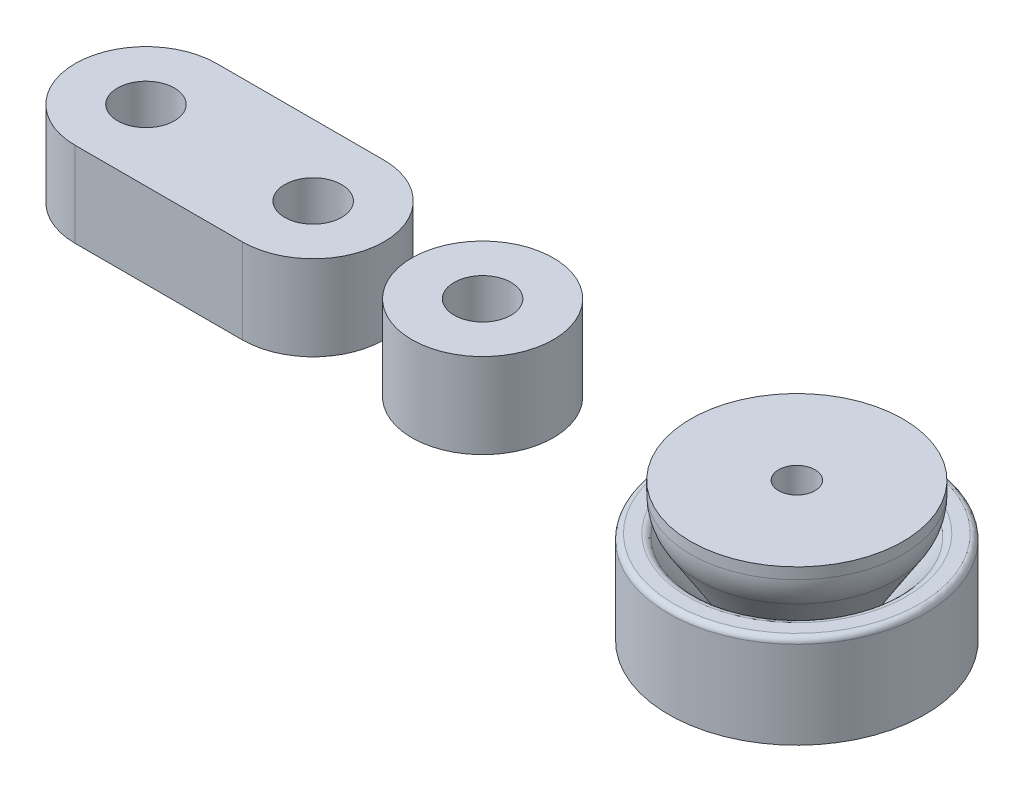
ISO-10303-21;
HEADER;
FILE_DESCRIPTION(('STEP AP214'),'2;1');
FILE_NAME('part.step','',(''),(''),'','','');
FILE_SCHEMA(('AUTOMOTIVE_DESIGN { 1 0 10303 214 1 1 1 1 }'));
ENDSEC;
DATA;
#1=APPLICATION_CONTEXT('core data for automotive mechanical design processes');
#2=APPLICATION_PROTOCOL_DEFINITION('international standard','automotive_design',2000,#1);
#3=PRODUCT_CONTEXT('',#1,'mechanical');
#4=PRODUCT('Part','Part','',(#3));
#5=PRODUCT_RELATED_PRODUCT_CATEGORY('part','',(#4));
#6=PRODUCT_DEFINITION_FORMATION('','',#4);
#7=PRODUCT_DEFINITION_CONTEXT('part definition',#1,'design');
#8=PRODUCT_DEFINITION('design','',#6,#7);
#9=PRODUCT_DEFINITION_SHAPE('','',#8);
#10=(LENGTH_UNIT() NAMED_UNIT(*) SI_UNIT(.MILLI.,.METRE.));
#11=(NAMED_UNIT(*) PLANE_ANGLE_UNIT() SI_UNIT($,.RADIAN.));
#12=(NAMED_UNIT(*) SI_UNIT($,.STERADIAN.) SOLID_ANGLE_UNIT());
#13=UNCERTAINTY_MEASURE_WITH_UNIT(LENGTH_MEASURE(1.E-05),#10,'distance_accuracy_value','');
#14=(GEOMETRIC_REPRESENTATION_CONTEXT(3) GLOBAL_UNCERTAINTY_ASSIGNED_CONTEXT((#13)) GLOBAL_UNIT_ASSIGNED_CONTEXT((#10,
#11,#12)) REPRESENTATION_CONTEXT('',''));
#15=CARTESIAN_POINT('',(0.,0.,0.));
#16=DIRECTION('',(0.,0.,1.));
#17=DIRECTION('',(1.,0.,0.));
#18=AXIS2_PLACEMENT_3D('',#15,#16,#17);
#19=CARTESIAN_POINT('',(-58.3806821295014,12.4587,0.));
#20=DIRECTION('',(0.,-1.,0.));
#21=DIRECTION('',(0.,0.,-1.));
#22=AXIS2_PLACEMENT_3D('',#19,#20,#21);
#23=CYLINDRICAL_SURFACE('',#22,6.35);
#24=CARTESIAN_POINT('',(-58.3806821295014,4.8387,0.));
#25=DIRECTION('',(0.,1.,0.));
#26=DIRECTION('',(0.,0.,1.));
#27=AXIS2_PLACEMENT_3D('',#24,#25,#26);
#28=CIRCLE('',#27,6.35);
#29=CARTESIAN_POINT('',(-58.3806821295014,4.8387,-6.35));
#30=VERTEX_POINT('',#29);
#31=CARTESIAN_POINT('',(-58.3806821295014,4.8387,6.35));
#32=VERTEX_POINT('',#31);
#33=EDGE_CURVE('E108',#30,#32,#28,.T.);
#34=ORIENTED_EDGE('',*,*,#33,.T.);
#35=DIRECTION('',(0.,-1.,0.));
#36=VECTOR('',#35,1.);
#37=CARTESIAN_POINT('',(-58.3806821295014,12.4587,6.35));
#38=LINE('',#37,#36);
#39=CARTESIAN_POINT('',(-58.3806821295014,12.4587,6.35));
#40=VERTEX_POINT('',#39);
#41=EDGE_CURVE('E12',#40,#32,#38,.T.);
#42=ORIENTED_EDGE('',*,*,#41,.F.);
#43=CARTESIAN_POINT('',(-58.3806821295014,12.4587,0.));
#44=DIRECTION('',(0.,1.,0.));
#45=DIRECTION('',(0.,0.,1.));
#46=AXIS2_PLACEMENT_3D('',#43,#44,#45);
#47=CIRCLE('',#46,6.35);
#48=CARTESIAN_POINT('',(-58.3806821295014,12.4587,-6.35));
#49=VERTEX_POINT('',#48);
#50=EDGE_CURVE('E96',#49,#40,#47,.T.);
#51=ORIENTED_EDGE('',*,*,#50,.F.);
#52=DIRECTION('',(0.,-1.,0.));
#53=VECTOR('',#52,1.);
#54=CARTESIAN_POINT('',(-58.3806821295014,12.4587,-6.35));
#55=LINE('',#54,#53);
#56=EDGE_CURVE('E104',#49,#30,#55,.T.);
#57=ORIENTED_EDGE('',*,*,#56,.T.);
#58=EDGE_LOOP('',(#34,#42,#51,#57));
#59=FACE_BOUND('',#58,.T.);
#60=ADVANCED_FACE('F45',(#59),#23,.T.);
#61=CARTESIAN_POINT('',(-58.3806821295014,12.4587,6.35));
#62=DIRECTION('',(0.,0.,-1.));
#63=DIRECTION('',(-1.,0.,0.));
#64=AXIS2_PLACEMENT_3D('',#61,#62,#63);
#65=PLANE('',#64);
#66=DIRECTION('',(1.,0.,0.));
#67=VECTOR('',#66,1.);
#68=CARTESIAN_POINT('',(-58.3806821295014,4.8387,6.35));
#69=LINE('',#68,#67);
#70=CARTESIAN_POINT('',(-43.3806821295014,4.8387,6.35));
#71=VERTEX_POINT('',#70);
#72=EDGE_CURVE('E100',#32,#71,#69,.T.);
#73=ORIENTED_EDGE('',*,*,#72,.T.);
#74=DIRECTION('',(0.,-1.,0.));
#75=VECTOR('',#74,1.);
#76=CARTESIAN_POINT('',(-43.3806821295014,12.4587,6.35));
#77=LINE('',#76,#75);
#78=CARTESIAN_POINT('',(-43.3806821295014,12.4587,6.35));
#79=VERTEX_POINT('',#78);
#80=EDGE_CURVE('E53',#79,#71,#77,.T.);
#81=ORIENTED_EDGE('',*,*,#80,.F.);
#82=DIRECTION('',(1.,0.,0.));
#83=VECTOR('',#82,1.);
#84=CARTESIAN_POINT('',(-58.3806821295014,12.4587,6.35));
#85=LINE('',#84,#83);
#86=EDGE_CURVE('E91',#40,#79,#85,.T.);
#87=ORIENTED_EDGE('',*,*,#86,.F.);
#88=ORIENTED_EDGE('',*,*,#41,.T.);
#89=EDGE_LOOP('',(#73,#81,#87,#88));
#90=FACE_BOUND('',#89,.T.);
#91=ADVANCED_FACE('F99',(#90),#65,.F.);
#92=CARTESIAN_POINT('',(-43.3806821295014,12.4587,0.));
#93=DIRECTION('',(0.,-1.,0.));
#94=DIRECTION('',(0.,0.,-1.));
#95=AXIS2_PLACEMENT_3D('',#92,#93,#94);
#96=CYLINDRICAL_SURFACE('',#95,6.35);
#97=CARTESIAN_POINT('',(-43.3806821295014,4.8387,0.));
#98=DIRECTION('',(0.,1.,0.));
#99=DIRECTION('',(0.,0.,1.));
#100=AXIS2_PLACEMENT_3D('',#97,#98,#99);
#101=CIRCLE('',#100,6.35);
#102=CARTESIAN_POINT('',(-43.3806821295014,4.8387,-6.35));
#103=VERTEX_POINT('',#102);
#104=EDGE_CURVE('E78',#71,#103,#101,.T.);
#105=ORIENTED_EDGE('',*,*,#104,.T.);
#106=DIRECTION('',(0.,-1.,0.));
#107=VECTOR('',#106,1.);
#108=CARTESIAN_POINT('',(-43.3806821295014,12.4587,-6.35));
#109=LINE('',#108,#107);
#110=CARTESIAN_POINT('',(-43.3806821295014,12.4587,-6.35));
#111=VERTEX_POINT('',#110);
#112=EDGE_CURVE('E101',#111,#103,#109,.T.);
#113=ORIENTED_EDGE('',*,*,#112,.F.);
#114=CARTESIAN_POINT('',(-43.3806821295014,12.4587,0.));
#115=DIRECTION('',(0.,1.,0.));
#116=DIRECTION('',(0.,0.,1.));
#117=AXIS2_PLACEMENT_3D('',#114,#115,#116);
#118=CIRCLE('',#117,6.35);
#119=EDGE_CURVE('E94',#79,#111,#118,.T.);
#120=ORIENTED_EDGE('',*,*,#119,.F.);
#121=ORIENTED_EDGE('',*,*,#80,.T.);
#122=EDGE_LOOP('',(#105,#113,#120,#121));
#123=FACE_BOUND('',#122,.T.);
#124=ADVANCED_FACE('F102',(#123),#96,.T.);
#125=CARTESIAN_POINT('',(-58.3806821295014,12.4587,-6.35));
#126=DIRECTION('',(0.,0.,1.));
#127=DIRECTION('',(1.,0.,0.));
#128=AXIS2_PLACEMENT_3D('',#125,#126,#127);
#129=PLANE('',#128);
#130=DIRECTION('',(-1.,0.,0.));
#131=VECTOR('',#130,1.);
#132=CARTESIAN_POINT('',(-58.3806821295014,4.8387,-6.35));
#133=LINE('',#132,#131);
#134=EDGE_CURVE('E84',#103,#30,#133,.T.);
#135=ORIENTED_EDGE('',*,*,#134,.T.);
#136=ORIENTED_EDGE('',*,*,#56,.F.);
#137=DIRECTION('',(-1.,0.,0.));
#138=VECTOR('',#137,1.);
#139=CARTESIAN_POINT('',(-58.3806821295014,12.4587,-6.35));
#140=LINE('',#139,#138);
#141=EDGE_CURVE('E61',#111,#49,#140,.T.);
#142=ORIENTED_EDGE('',*,*,#141,.F.);
#143=ORIENTED_EDGE('',*,*,#112,.T.);
#144=EDGE_LOOP('',(#135,#136,#142,#143));
#145=FACE_BOUND('',#144,.T.);
#146=ADVANCED_FACE('F116',(#145),#129,.F.);
#147=CARTESIAN_POINT('',(-58.3806821295014,12.4587,0.));
#148=DIRECTION('',(0.,1.,0.));
#149=DIRECTION('',(0.,0.,1.));
#150=AXIS2_PLACEMENT_3D('',#147,#148,#149);
#151=PLANE('',#150);
#152=CARTESIAN_POINT('',(-43.3806821295014,12.4587,0.));
#153=DIRECTION('',(0.,-1.,0.));
#154=DIRECTION('',(0.,0.,-1.));
#155=AXIS2_PLACEMENT_3D('',#152,#153,#154);
#156=CIRCLE('',#155,2.5527);
#157=CARTESIAN_POINT('',(-43.3806821295014,12.4587,-2.5527));
#158=VERTEX_POINT('',#157);
#159=EDGE_CURVE('E130',#158,#158,#156,.T.);
#160=ORIENTED_EDGE('',*,*,#159,.T.);
#161=EDGE_LOOP('',(#160));
#162=FACE_BOUND('',#161,.T.);
#163=CARTESIAN_POINT('',(-58.3806821295014,12.4587,0.));
#164=DIRECTION('',(0.,-1.,0.));
#165=DIRECTION('',(0.,0.,-1.));
#166=AXIS2_PLACEMENT_3D('',#163,#164,#165);
#167=CIRCLE('',#166,2.5527);
#168=CARTESIAN_POINT('',(-58.3806821295014,12.4587,-2.5527));
#169=VERTEX_POINT('',#168);
#170=EDGE_CURVE('E111',#169,#169,#167,.T.);
#171=ORIENTED_EDGE('',*,*,#170,.T.);
#172=EDGE_LOOP('',(#171));
#173=FACE_BOUND('',#172,.T.);
#174=ORIENTED_EDGE('',*,*,#50,.T.);
#175=ORIENTED_EDGE('',*,*,#86,.T.);
#176=ORIENTED_EDGE('',*,*,#119,.T.);
#177=ORIENTED_EDGE('',*,*,#141,.T.);
#178=EDGE_LOOP('',(#174,#175,#176,#177));
#179=FACE_BOUND('',#178,.T.);
#180=ADVANCED_FACE('F92',(#162,#173,#179),#151,.T.);
#181=CARTESIAN_POINT('',(-58.3806821295014,4.8387,0.));
#182=DIRECTION('',(0.,1.,0.));
#183=DIRECTION('',(0.,0.,1.));
#184=AXIS2_PLACEMENT_3D('',#181,#182,#183);
#185=PLANE('',#184);
#186=CARTESIAN_POINT('',(-43.3806821295014,4.8387,0.));
#187=DIRECTION('',(0.,-1.,0.));
#188=DIRECTION('',(0.,0.,-1.));
#189=AXIS2_PLACEMENT_3D('',#186,#187,#188);
#190=CIRCLE('',#189,4.953);
#191=CARTESIAN_POINT('',(-43.3806821295014,4.8387,-4.953));
#192=VERTEX_POINT('',#191);
#193=EDGE_CURVE('E136',#192,#192,#190,.T.);
#194=ORIENTED_EDGE('',*,*,#193,.F.);
#195=EDGE_LOOP('',(#194));
#196=FACE_BOUND('',#195,.T.);
#197=CARTESIAN_POINT('',(-58.3806821295014,4.8387,0.));
#198=DIRECTION('',(0.,-1.,0.));
#199=DIRECTION('',(0.,0.,-1.));
#200=AXIS2_PLACEMENT_3D('',#197,#198,#199);
#201=CIRCLE('',#200,4.953);
#202=CARTESIAN_POINT('',(-58.3806821295014,4.8387,-4.953));
#203=VERTEX_POINT('',#202);
#204=EDGE_CURVE('E127',#203,#203,#201,.T.);
#205=ORIENTED_EDGE('',*,*,#204,.F.);
#206=EDGE_LOOP('',(#205));
#207=FACE_BOUND('',#206,.T.);
#208=ORIENTED_EDGE('',*,*,#33,.F.);
#209=ORIENTED_EDGE('',*,*,#134,.F.);
#210=ORIENTED_EDGE('',*,*,#104,.F.);
#211=ORIENTED_EDGE('',*,*,#72,.F.);
#212=EDGE_LOOP('',(#208,#209,#210,#211));
#213=FACE_BOUND('',#212,.T.);
#214=ADVANCED_FACE('F119',(#196,#207,#213),#185,.F.);
#215=CARTESIAN_POINT('',(-58.3806821295014,4.8387,0.));
#216=DIRECTION('',(0.,-1.,0.));
#217=DIRECTION('',(0.,0.,-1.));
#218=AXIS2_PLACEMENT_3D('',#215,#216,#217);
#219=CYLINDRICAL_SURFACE('',#218,2.5527);
#220=ORIENTED_EDGE('',*,*,#170,.F.);
#221=EDGE_LOOP('',(#220));
#222=FACE_BOUND('',#221,.T.);
#223=CARTESIAN_POINT('',(-58.3806821295014,7.59992928785259,0.));
#224=DIRECTION('',(0.,-1.,0.));
#225=DIRECTION('',(0.,0.,-1.));
#226=AXIS2_PLACEMENT_3D('',#223,#224,#225);
#227=CIRCLE('',#226,2.5527);
#228=CARTESIAN_POINT('',(-58.3806821295014,7.59992928785259,-2.5527));
#229=VERTEX_POINT('',#228);
#230=EDGE_CURVE('E124',#229,#229,#227,.T.);
#231=ORIENTED_EDGE('',*,*,#230,.T.);
#232=EDGE_LOOP('',(#231));
#233=FACE_BOUND('',#232,.T.);
#234=ADVANCED_FACE('F144',(#222,#233),#219,.F.);
#235=CARTESIAN_POINT('',(-58.3806821295014,4.8387,0.));
#236=DIRECTION('',(0.,-1.,0.));
#237=DIRECTION('',(0.,0.,-1.));
#238=AXIS2_PLACEMENT_3D('',#235,#236,#237);
#239=CONICAL_SURFACE('',#238,4.953,0.715584993317675);
#240=ORIENTED_EDGE('',*,*,#230,.F.);
#241=EDGE_LOOP('',(#240));
#242=FACE_BOUND('',#241,.T.);
#243=ORIENTED_EDGE('',*,*,#204,.T.);
#244=EDGE_LOOP('',(#243));
#245=FACE_BOUND('',#244,.T.);
#246=ADVANCED_FACE('F148',(#242,#245),#239,.F.);
#247=CARTESIAN_POINT('',(-43.3806821295014,4.8387,0.));
#248=DIRECTION('',(0.,-1.,0.));
#249=DIRECTION('',(0.,0.,-1.));
#250=AXIS2_PLACEMENT_3D('',#247,#248,#249);
#251=CYLINDRICAL_SURFACE('',#250,2.5527);
#252=ORIENTED_EDGE('',*,*,#159,.F.);
#253=EDGE_LOOP('',(#252));
#254=FACE_BOUND('',#253,.T.);
#255=CARTESIAN_POINT('',(-43.3806821295014,7.59992928785259,0.));
#256=DIRECTION('',(0.,-1.,0.));
#257=DIRECTION('',(0.,0.,-1.));
#258=AXIS2_PLACEMENT_3D('',#255,#256,#257);
#259=CIRCLE('',#258,2.5527);
#260=CARTESIAN_POINT('',(-43.3806821295014,7.59992928785259,-2.5527));
#261=VERTEX_POINT('',#260);
#262=EDGE_CURVE('E133',#261,#261,#259,.T.);
#263=ORIENTED_EDGE('',*,*,#262,.T.);
#264=EDGE_LOOP('',(#263));
#265=FACE_BOUND('',#264,.T.);
#266=ADVANCED_FACE('F150',(#254,#265),#251,.F.);
#267=CARTESIAN_POINT('',(-43.3806821295014,4.8387,0.));
#268=DIRECTION('',(0.,-1.,0.));
#269=DIRECTION('',(0.,0.,-1.));
#270=AXIS2_PLACEMENT_3D('',#267,#268,#269);
#271=CONICAL_SURFACE('',#270,4.953,0.715584993317675);
#272=ORIENTED_EDGE('',*,*,#262,.F.);
#273=EDGE_LOOP('',(#272));
#274=FACE_BOUND('',#273,.T.);
#275=ORIENTED_EDGE('',*,*,#193,.T.);
#276=EDGE_LOOP('',(#275));
#277=FACE_BOUND('',#276,.T.);
#278=ADVANCED_FACE('F140',(#274,#277),#271,.F.);
#279=CLOSED_SHELL('',(#60,#91,#124,#146,#180,#214,#234,#246,#266,#278));
#280=MANIFOLD_SOLID_BREP('B2',#279);
#281=CARTESIAN_POINT('',(-28.1819919062988,12.4587,0.));
#282=DIRECTION('',(0.,-1.,0.));
#283=DIRECTION('',(0.,0.,-1.));
#284=AXIS2_PLACEMENT_3D('',#281,#282,#283);
#285=CYLINDRICAL_SURFACE('',#284,6.35);
#286=CARTESIAN_POINT('',(-28.1819919062988,12.4587,0.));
#287=DIRECTION('',(0.,1.,0.));
#288=DIRECTION('',(0.,0.,1.));
#289=AXIS2_PLACEMENT_3D('',#286,#287,#288);
#290=CIRCLE('',#289,6.35);
#291=CARTESIAN_POINT('',(-28.1819919062988,12.4587,6.35));
#292=VERTEX_POINT('',#291);
#293=EDGE_CURVE('E44',#292,#292,#290,.T.);
#294=ORIENTED_EDGE('',*,*,#293,.F.);
#295=EDGE_LOOP('',(#294));
#296=FACE_BOUND('',#295,.T.);
#297=CARTESIAN_POINT('',(-28.1819919062988,4.8387,0.));
#298=DIRECTION('',(0.,1.,0.));
#299=DIRECTION('',(0.,0.,1.));
#300=AXIS2_PLACEMENT_3D('',#297,#298,#299);
#301=CIRCLE('',#300,6.35);
#302=CARTESIAN_POINT('',(-28.1819919062988,4.8387,6.35));
#303=VERTEX_POINT('',#302);
#304=EDGE_CURVE('E251',#303,#303,#301,.T.);
#305=ORIENTED_EDGE('',*,*,#304,.T.);
#306=EDGE_LOOP('',(#305));
#307=FACE_BOUND('',#306,.T.);
#308=ADVANCED_FACE('F248',(#296,#307),#285,.T.);
#309=CARTESIAN_POINT('',(-28.1819919062988,12.4587,0.));
#310=DIRECTION('',(0.,1.,0.));
#311=DIRECTION('',(0.,0.,1.));
#312=AXIS2_PLACEMENT_3D('',#309,#310,#311);
#313=PLANE('',#312);
#314=CARTESIAN_POINT('',(-28.1819919062988,12.4587,0.));
#315=DIRECTION('',(0.,-1.,0.));
#316=DIRECTION('',(0.,0.,-1.));
#317=AXIS2_PLACEMENT_3D('',#314,#315,#316);
#318=CIRCLE('',#317,2.5527);
#319=CARTESIAN_POINT('',(-28.1819919062988,12.4587,-2.5527));
#320=VERTEX_POINT('',#319);
#321=EDGE_CURVE('E258',#320,#320,#318,.T.);
#322=ORIENTED_EDGE('',*,*,#321,.T.);
#323=EDGE_LOOP('',(#322));
#324=FACE_BOUND('',#323,.T.);
#325=ORIENTED_EDGE('',*,*,#293,.T.);
#326=EDGE_LOOP('',(#325));
#327=FACE_BOUND('',#326,.T.);
#328=ADVANCED_FACE('F275',(#324,#327),#313,.T.);
#329=CARTESIAN_POINT('',(-28.1819919062988,4.8387,0.));
#330=DIRECTION('',(0.,1.,0.));
#331=DIRECTION('',(0.,0.,1.));
#332=AXIS2_PLACEMENT_3D('',#329,#330,#331);
#333=PLANE('',#332);
#334=CARTESIAN_POINT('',(-28.1819919062988,4.8387,0.));
#335=DIRECTION('',(0.,-1.,0.));
#336=DIRECTION('',(0.,0.,-1.));
#337=AXIS2_PLACEMENT_3D('',#334,#335,#336);
#338=CIRCLE('',#337,4.953);
#339=CARTESIAN_POINT('',(-28.1819919062988,4.8387,-4.953));
#340=VERTEX_POINT('',#339);
#341=EDGE_CURVE('E265',#340,#340,#338,.T.);
#342=ORIENTED_EDGE('',*,*,#341,.F.);
#343=EDGE_LOOP('',(#342));
#344=FACE_BOUND('',#343,.T.);
#345=ORIENTED_EDGE('',*,*,#304,.F.);
#346=EDGE_LOOP('',(#345));
#347=FACE_BOUND('',#346,.T.);
#348=ADVANCED_FACE('F271',(#344,#347),#333,.F.);
#349=CARTESIAN_POINT('',(-28.1819919062988,4.8387,0.));
#350=DIRECTION('',(0.,-1.,0.));
#351=DIRECTION('',(0.,0.,-1.));
#352=AXIS2_PLACEMENT_3D('',#349,#350,#351);
#353=CYLINDRICAL_SURFACE('',#352,2.5527);
#354=ORIENTED_EDGE('',*,*,#321,.F.);
#355=EDGE_LOOP('',(#354));
#356=FACE_BOUND('',#355,.T.);
#357=CARTESIAN_POINT('',(-28.1819919062988,7.59992928785259,0.));
#358=DIRECTION('',(0.,-1.,0.));
#359=DIRECTION('',(0.,0.,-1.));
#360=AXIS2_PLACEMENT_3D('',#357,#358,#359);
#361=CIRCLE('',#360,2.5527);
#362=CARTESIAN_POINT('',(-28.1819919062988,7.59992928785259,-2.5527));
#363=VERTEX_POINT('',#362);
#364=EDGE_CURVE('E262',#363,#363,#361,.T.);
#365=ORIENTED_EDGE('',*,*,#364,.T.);
#366=EDGE_LOOP('',(#365));
#367=FACE_BOUND('',#366,.T.);
#368=ADVANCED_FACE('F274',(#356,#367),#353,.F.);
#369=CARTESIAN_POINT('',(-28.1819919062988,4.8387,0.));
#370=DIRECTION('',(0.,-1.,0.));
#371=DIRECTION('',(0.,0.,-1.));
#372=AXIS2_PLACEMENT_3D('',#369,#370,#371);
#373=CONICAL_SURFACE('',#372,4.953,0.715584993317675);
#374=ORIENTED_EDGE('',*,*,#364,.F.);
#375=EDGE_LOOP('',(#374));
#376=FACE_BOUND('',#375,.T.);
#377=ORIENTED_EDGE('',*,*,#341,.T.);
#378=EDGE_LOOP('',(#377));
#379=FACE_BOUND('',#378,.T.);
#380=ADVANCED_FACE('F269',(#376,#379),#373,.F.);
#381=CLOSED_SHELL('',(#308,#328,#348,#368,#380));
#382=MANIFOLD_SOLID_BREP('B6',#381);
#383=CARTESIAN_POINT('',(0.,0.,0.));
#384=DIRECTION('',(0.,1.,0.));
#385=DIRECTION('',(0.,0.,1.));
#386=AXIS2_PLACEMENT_3D('',#383,#384,#385);
#387=PLANE('',#386);
#388=CARTESIAN_POINT('',(0.,0.,0.));
#389=DIRECTION('',(0.,1.,0.));
#390=DIRECTION('',(0.,0.,1.));
#391=AXIS2_PLACEMENT_3D('',#388,#389,#390);
#392=CIRCLE('',#391,1.63195);
#393=CARTESIAN_POINT('',(0.,0.,1.63195));
#394=VERTEX_POINT('',#393);
#395=EDGE_CURVE('E334',#394,#394,#392,.T.);
#396=ORIENTED_EDGE('',*,*,#395,.T.);
#397=EDGE_LOOP('',(#396));
#398=FACE_BOUND('',#397,.T.);
#399=CARTESIAN_POINT('',(0.,0.,0.));
#400=DIRECTION('',(0.,-1.,0.));
#401=DIRECTION('',(0.,0.,-1.));
#402=AXIS2_PLACEMENT_3D('',#399,#400,#401);
#403=CIRCLE('',#402,11.5);
#404=CARTESIAN_POINT('',(0.,0.,-11.5));
#405=VERTEX_POINT('',#404);
#406=EDGE_CURVE('E247',#405,#405,#403,.T.);
#407=ORIENTED_EDGE('',*,*,#406,.T.);
#408=EDGE_LOOP('',(#407));
#409=FACE_BOUND('',#408,.T.);
#410=ADVANCED_FACE('F331',(#398,#409),#387,.F.);
#411=CARTESIAN_POINT('',(0.,0.,0.));
#412=DIRECTION('',(0.,-1.,0.));
#413=DIRECTION('',(0.,0.,-1.));
#414=AXIS2_PLACEMENT_3D('',#411,#412,#413);
#415=CYLINDRICAL_SURFACE('',#414,11.5);
#416=ORIENTED_EDGE('',*,*,#406,.F.);
#417=EDGE_LOOP('',(#416));
#418=FACE_BOUND('',#417,.T.);
#419=CARTESIAN_POINT('',(0.,7.8387,0.));
#420=DIRECTION('',(0.,-1.,0.));
#421=DIRECTION('',(0.,0.,-1.));
#422=AXIS2_PLACEMENT_3D('',#419,#420,#421);
#423=CIRCLE('',#422,11.5);
#424=CARTESIAN_POINT('',(0.,7.8387,-11.5));
#425=VERTEX_POINT('',#424);
#426=EDGE_CURVE('E338',#425,#425,#423,.T.);
#427=ORIENTED_EDGE('',*,*,#426,.T.);
#428=EDGE_LOOP('',(#427));
#429=FACE_BOUND('',#428,.T.);
#430=ADVANCED_FACE('F388',(#418,#429),#415,.T.);
#431=CARTESIAN_POINT('',(0.,7.8387,0.));
#432=DIRECTION('',(0.,-1.,0.));
#433=DIRECTION('',(0.,0.,-1.));
#434=AXIS2_PLACEMENT_3D('',#431,#432,#433);
#435=TOROIDAL_SURFACE('',#434,11.,0.5);
#436=ORIENTED_EDGE('',*,*,#426,.F.);
#437=EDGE_LOOP('',(#436));
#438=FACE_BOUND('',#437,.T.);
#439=CARTESIAN_POINT('',(0.,8.3387,0.));
#440=DIRECTION('',(0.,-1.,0.));
#441=DIRECTION('',(0.,0.,-1.));
#442=AXIS2_PLACEMENT_3D('',#439,#440,#441);
#443=CIRCLE('',#442,11.);
#444=CARTESIAN_POINT('',(0.,8.3387,-11.));
#445=VERTEX_POINT('',#444);
#446=EDGE_CURVE('E342',#445,#445,#443,.T.);
#447=ORIENTED_EDGE('',*,*,#446,.T.);
#448=EDGE_LOOP('',(#447));
#449=FACE_BOUND('',#448,.T.);
#450=ADVANCED_FACE('F393',(#438,#449),#435,.T.);
#451=CARTESIAN_POINT('',(-9.83302511448317,8.3387,0.));
#452=DIRECTION('',(0.,-1.,0.));
#453=DIRECTION('',(0.,0.,-1.));
#454=AXIS2_PLACEMENT_3D('',#451,#452,#453);
#455=PLANE('',#454);
#456=ORIENTED_EDGE('',*,*,#446,.F.);
#457=EDGE_LOOP('',(#456));
#458=FACE_BOUND('',#457,.T.);
#459=CARTESIAN_POINT('',(0.,8.3387,0.));
#460=DIRECTION('',(0.,-1.,0.));
#461=DIRECTION('',(0.,0.,-1.));
#462=AXIS2_PLACEMENT_3D('',#459,#460,#461);
#463=CIRCLE('',#462,9.83302511448317);
#464=CARTESIAN_POINT('',(0.,8.3387,-9.83302511448317));
#465=VERTEX_POINT('',#464);
#466=EDGE_CURVE('E347',#465,#465,#463,.T.);
#467=ORIENTED_EDGE('',*,*,#466,.T.);
#468=EDGE_LOOP('',(#467));
#469=FACE_BOUND('',#468,.T.);
#470=ADVANCED_FACE('F443',(#458,#469),#455,.F.);
#471=CARTESIAN_POINT('',(0.,7.5887,0.));
#472=DIRECTION('',(0.,-1.,0.));
#473=DIRECTION('',(0.,0.,-1.));
#474=AXIS2_PLACEMENT_3D('',#471,#472,#473);
#475=TOROIDAL_SURFACE('',#474,9.83302511448317,0.749999999999999);
#476=ORIENTED_EDGE('',*,*,#466,.F.);
#477=EDGE_LOOP('',(#476));
#478=FACE_BOUND('',#477,.T.);
#479=CARTESIAN_POINT('',(0.,8.06918678593173,0.));
#480=DIRECTION('',(0.,-1.,0.));
#481=DIRECTION('',(0.,0.,-1.));
#482=AXIS2_PLACEMENT_3D('',#479,#480,#481);
#483=CIRCLE('',#482,9.25714973860312);
#484=CARTESIAN_POINT('',(0.,8.06918678593173,-9.25714973860312));
#485=VERTEX_POINT('',#484);
#486=EDGE_CURVE('E350',#485,#485,#483,.T.);
#487=ORIENTED_EDGE('',*,*,#486,.T.);
#488=EDGE_LOOP('',(#487));
#489=FACE_BOUND('',#488,.T.);
#490=ADVANCED_FACE('F383',(#478,#489),#475,.T.);
#491=CARTESIAN_POINT('',(0.,3.3387,0.));
#492=DIRECTION('',(0.,1.,0.));
#493=DIRECTION('',(0.,0.,1.));
#494=AXIS2_PLACEMENT_3D('',#491,#492,#493);
#495=CONICAL_SURFACE('',#494,5.31022565248222,0.695343265205321);
#496=ORIENTED_EDGE('',*,*,#486,.F.);
#497=EDGE_LOOP('',(#496));
#498=FACE_BOUND('',#497,.T.);
#499=CARTESIAN_POINT('',(0.,3.3387,0.));
#500=DIRECTION('',(0.,-1.,0.));
#501=DIRECTION('',(0.,0.,-1.));
#502=AXIS2_PLACEMENT_3D('',#499,#500,#501);
#503=CIRCLE('',#502,5.31022565248222);
#504=CARTESIAN_POINT('',(0.,3.3387,-5.31022565248222));
#505=VERTEX_POINT('',#504);
#506=EDGE_CURVE('E353',#505,#505,#503,.T.);
#507=ORIENTED_EDGE('',*,*,#506,.T.);
#508=EDGE_LOOP('',(#507));
#509=FACE_BOUND('',#508,.T.);
#510=ADVANCED_FACE('F377',(#498,#509),#495,.F.);
#511=CARTESIAN_POINT('',(0.,4.23009745446774,0.));
#512=DIRECTION('',(0.,-1.,0.));
#513=DIRECTION('',(0.,0.,-1.));
#514=AXIS2_PLACEMENT_3D('',#511,#512,#513);
#515=TOROIDAL_SURFACE('',#514,4.24186360969534,1.39139745446774);
#516=ORIENTED_EDGE('',*,*,#506,.F.);
#517=EDGE_LOOP('',(#516));
#518=FACE_BOUND('',#517,.T.);
#519=CARTESIAN_POINT('',(0.,2.8387,0.));
#520=DIRECTION('',(0.,-1.,0.));
#521=DIRECTION('',(0.,0.,-1.));
#522=AXIS2_PLACEMENT_3D('',#519,#520,#521);
#523=CIRCLE('',#522,4.24186360969534);
#524=CARTESIAN_POINT('',(0.,2.8387,-4.24186360969534));
#525=VERTEX_POINT('',#524);
#526=EDGE_CURVE('E356',#525,#525,#523,.T.);
#527=ORIENTED_EDGE('',*,*,#526,.T.);
#528=EDGE_LOOP('',(#527));
#529=FACE_BOUND('',#528,.T.);
#530=ADVANCED_FACE('F372',(#518,#529),#515,.F.);
#531=CARTESIAN_POINT('',(0.,2.8387,0.));
#532=DIRECTION('',(0.,-1.,0.));
#533=DIRECTION('',(0.,0.,-1.));
#534=AXIS2_PLACEMENT_3D('',#531,#532,#533);
#535=PLANE('',#534);
#536=CARTESIAN_POINT('',(0.,2.8387,0.));
#537=DIRECTION('',(0.,1.,0.));
#538=DIRECTION('',(0.,0.,1.));
#539=AXIS2_PLACEMENT_3D('',#536,#537,#538);
#540=CIRCLE('',#539,3.2385);
#541=CARTESIAN_POINT('',(0.,2.8387,3.2385));
#542=VERTEX_POINT('',#541);
#543=EDGE_CURVE('E362',#542,#542,#540,.T.);
#544=ORIENTED_EDGE('',*,*,#543,.F.);
#545=EDGE_LOOP('',(#544));
#546=FACE_BOUND('',#545,.T.);
#547=ORIENTED_EDGE('',*,*,#526,.F.);
#548=EDGE_LOOP('',(#547));
#549=FACE_BOUND('',#548,.T.);
#550=ADVANCED_FACE('F368',(#546,#549),#535,.F.);
#551=CARTESIAN_POINT('',(0.,2.8387,0.));
#552=DIRECTION('',(0.,1.,0.));
#553=DIRECTION('',(0.,0.,1.));
#554=AXIS2_PLACEMENT_3D('',#551,#552,#553);
#555=CYLINDRICAL_SURFACE('',#554,1.63195);
#556=CARTESIAN_POINT('',(0.,0.990575635379087,0.));
#557=DIRECTION('',(0.,1.,0.));
#558=DIRECTION('',(0.,0.,1.));
#559=AXIS2_PLACEMENT_3D('',#556,#557,#558);
#560=CIRCLE('',#559,1.63195);
#561=CARTESIAN_POINT('',(0.,0.990575635379087,1.63195));
#562=VERTEX_POINT('',#561);
#563=EDGE_CURVE('E359',#562,#562,#560,.T.);
#564=ORIENTED_EDGE('',*,*,#563,.T.);
#565=EDGE_LOOP('',(#564));
#566=FACE_BOUND('',#565,.T.);
#567=ORIENTED_EDGE('',*,*,#395,.F.);
#568=EDGE_LOOP('',(#567));
#569=FACE_BOUND('',#568,.T.);
#570=ADVANCED_FACE('F371',(#566,#569),#555,.F.);
#571=CARTESIAN_POINT('',(0.,2.8387,0.));
#572=DIRECTION('',(0.,1.,0.));
#573=DIRECTION('',(0.,0.,1.));
#574=AXIS2_PLACEMENT_3D('',#571,#572,#573);
#575=CONICAL_SURFACE('',#574,3.2385,0.715584993317675);
#576=ORIENTED_EDGE('',*,*,#563,.F.);
#577=EDGE_LOOP('',(#576));
#578=FACE_BOUND('',#577,.T.);
#579=ORIENTED_EDGE('',*,*,#543,.T.);
#580=EDGE_LOOP('',(#579));
#581=FACE_BOUND('',#580,.T.);
#582=ADVANCED_FACE('F366',(#578,#581),#575,.F.);
#583=CLOSED_SHELL('',(#410,#430,#450,#470,#490,#510,#530,#550,#570,#582));
#584=MANIFOLD_SOLID_BREP('B39',#583);
#585=CARTESIAN_POINT('',(-5.2385,3.8387,0.));
#586=DIRECTION('',(0.,1.,0.));
#587=DIRECTION('',(0.,0.,1.));
#588=AXIS2_PLACEMENT_3D('',#585,#586,#587);
#589=PLANE('',#588);
#590=CARTESIAN_POINT('',(0.,3.8387,0.));
#591=DIRECTION('',(0.,-1.,0.));
#592=DIRECTION('',(0.,0.,-1.));
#593=AXIS2_PLACEMENT_3D('',#590,#591,#592);
#594=CIRCLE('',#593,3.2385);
#595=CARTESIAN_POINT('',(0.,3.8387,-3.2385));
#596=VERTEX_POINT('',#595);
#597=EDGE_CURVE('E330',#596,#596,#594,.T.);
#598=ORIENTED_EDGE('',*,*,#597,.F.);
#599=EDGE_LOOP('',(#598));
#600=FACE_BOUND('',#599,.T.);
#601=CARTESIAN_POINT('',(0.,3.8387,0.));
#602=DIRECTION('',(0.,-1.,0.));
#603=DIRECTION('',(0.,0.,-1.));
#604=AXIS2_PLACEMENT_3D('',#601,#602,#603);
#605=CIRCLE('',#604,5.2385);
#606=CARTESIAN_POINT('',(0.,3.8387,-5.2385));
#607=VERTEX_POINT('',#606);
#608=EDGE_CURVE('E513',#607,#607,#605,.T.);
#609=ORIENTED_EDGE('',*,*,#608,.T.);
#610=EDGE_LOOP('',(#609));
#611=FACE_BOUND('',#610,.T.);
#612=ADVANCED_FACE('F482',(#600,#611),#589,.F.);
#613=CARTESIAN_POINT('',(0.,0.,0.));
#614=DIRECTION('',(0.,-1.,0.));
#615=DIRECTION('',(0.,0.,-1.));
#616=AXIS2_PLACEMENT_3D('',#613,#614,#615);
#617=CYLINDRICAL_SURFACE('',#616,3.2385);
#618=CARTESIAN_POINT('',(0.,7.3787,0.));
#619=DIRECTION('',(0.,-1.,0.));
#620=DIRECTION('',(0.,0.,-1.));
#621=AXIS2_PLACEMENT_3D('',#618,#619,#620);
#622=CIRCLE('',#621,3.2385);
#623=CARTESIAN_POINT('',(0.,7.3787,-3.2385));
#624=VERTEX_POINT('',#623);
#625=EDGE_CURVE('E488',#624,#624,#622,.T.);
#626=ORIENTED_EDGE('',*,*,#625,.F.);
#627=EDGE_LOOP('',(#626));
#628=FACE_BOUND('',#627,.T.);
#629=ORIENTED_EDGE('',*,*,#597,.T.);
#630=EDGE_LOOP('',(#629));
#631=FACE_BOUND('',#630,.T.);
#632=ADVANCED_FACE('F556',(#628,#631),#617,.F.);
#633=CARTESIAN_POINT('',(0.,7.3787,0.));
#634=DIRECTION('',(0.,-1.,0.));
#635=DIRECTION('',(0.,0.,-1.));
#636=AXIS2_PLACEMENT_3D('',#633,#634,#635);
#637=CONICAL_SURFACE('',#636,3.2385,0.715584993317669);
#638=CARTESIAN_POINT('',(0.,9.22682436462093,0.));
#639=DIRECTION('',(0.,-1.,0.));
#640=DIRECTION('',(0.,0.,-1.));
#641=AXIS2_PLACEMENT_3D('',#638,#639,#640);
#642=CIRCLE('',#641,1.63195);
#643=CARTESIAN_POINT('',(0.,9.22682436462093,-1.63195));
#644=VERTEX_POINT('',#643);
#645=EDGE_CURVE('E492',#644,#644,#642,.T.);
#646=ORIENTED_EDGE('',*,*,#645,.F.);
#647=EDGE_LOOP('',(#646));
#648=FACE_BOUND('',#647,.T.);
#649=ORIENTED_EDGE('',*,*,#625,.T.);
#650=EDGE_LOOP('',(#649));
#651=FACE_BOUND('',#650,.T.);
#652=ADVANCED_FACE('F551',(#648,#651),#637,.F.);
#653=CARTESIAN_POINT('',(0.,0.,0.));
#654=DIRECTION('',(0.,-1.,0.));
#655=DIRECTION('',(0.,0.,-1.));
#656=AXIS2_PLACEMENT_3D('',#653,#654,#655);
#657=CYLINDRICAL_SURFACE('',#656,1.63195);
#658=CARTESIAN_POINT('',(0.,12.4587,0.));
#659=DIRECTION('',(0.,-1.,0.));
#660=DIRECTION('',(0.,0.,-1.));
#661=AXIS2_PLACEMENT_3D('',#658,#659,#660);
#662=CIRCLE('',#661,1.63195);
#663=CARTESIAN_POINT('',(0.,12.4587,-1.63195));
#664=VERTEX_POINT('',#663);
#665=EDGE_CURVE('E496',#664,#664,#662,.T.);
#666=ORIENTED_EDGE('',*,*,#665,.F.);
#667=EDGE_LOOP('',(#666));
#668=FACE_BOUND('',#667,.T.);
#669=ORIENTED_EDGE('',*,*,#645,.T.);
#670=EDGE_LOOP('',(#669));
#671=FACE_BOUND('',#670,.T.);
#672=ADVANCED_FACE('F545',(#668,#671),#657,.F.);
#673=CARTESIAN_POINT('',(-1.63195,12.4587,0.));
#674=DIRECTION('',(0.,-1.,0.));
#675=DIRECTION('',(0.,0.,-1.));
#676=AXIS2_PLACEMENT_3D('',#673,#674,#675);
#677=PLANE('',#676);
#678=CARTESIAN_POINT('',(0.,12.4587,0.));
#679=DIRECTION('',(0.,-1.,0.));
#680=DIRECTION('',(0.,0.,-1.));
#681=AXIS2_PLACEMENT_3D('',#678,#679,#680);
#682=CIRCLE('',#681,9.525);
#683=CARTESIAN_POINT('',(0.,12.4587,-9.525));
#684=VERTEX_POINT('',#683);
#685=EDGE_CURVE('E501',#684,#684,#682,.T.);
#686=ORIENTED_EDGE('',*,*,#685,.F.);
#687=EDGE_LOOP('',(#686));
#688=FACE_BOUND('',#687,.T.);
#689=ORIENTED_EDGE('',*,*,#665,.T.);
#690=EDGE_LOOP('',(#689));
#691=FACE_BOUND('',#690,.T.);
#692=ADVANCED_FACE('F539',(#688,#691),#677,.F.);
#693=CARTESIAN_POINT('',(0.,0.,0.));
#694=DIRECTION('',(0.,-1.,0.));
#695=DIRECTION('',(0.,0.,-1.));
#696=AXIS2_PLACEMENT_3D('',#693,#694,#695);
#697=CYLINDRICAL_SURFACE('',#696,9.525);
#698=CARTESIAN_POINT('',(0.,11.4587,0.));
#699=DIRECTION('',(0.,-1.,0.));
#700=DIRECTION('',(0.,0.,-1.));
#701=AXIS2_PLACEMENT_3D('',#698,#699,#700);
#702=CIRCLE('',#701,9.525);
#703=CARTESIAN_POINT('',(0.,11.4587,-9.525));
#704=VERTEX_POINT('',#703);
#705=EDGE_CURVE('E504',#704,#704,#702,.T.);
#706=ORIENTED_EDGE('',*,*,#705,.F.);
#707=EDGE_LOOP('',(#706));
#708=FACE_BOUND('',#707,.T.);
#709=ORIENTED_EDGE('',*,*,#685,.T.);
#710=EDGE_LOOP('',(#709));
#711=FACE_BOUND('',#710,.T.);
#712=ADVANCED_FACE('F533',(#708,#711),#697,.T.);
#713=CARTESIAN_POINT('',(0.,11.4587,0.));
#714=DIRECTION('',(0.,-1.,0.));
#715=DIRECTION('',(0.,0.,-1.));
#716=AXIS2_PLACEMENT_3D('',#713,#714,#715);
#717=TOROIDAL_SURFACE('',#716,5.09464445853084,4.43035554146916);
#718=CARTESIAN_POINT('',(0.,9.0887,0.));
#719=DIRECTION('',(0.,-1.,0.));
#720=DIRECTION('',(0.,0.,-1.));
#721=AXIS2_PLACEMENT_3D('',#718,#719,#720);
#722=CIRCLE('',#721,8.83779156007875);
#723=CARTESIAN_POINT('',(0.,9.0887,-8.83779156007875));
#724=VERTEX_POINT('',#723);
#725=EDGE_CURVE('E507',#724,#724,#722,.T.);
#726=ORIENTED_EDGE('',*,*,#725,.F.);
#727=EDGE_LOOP('',(#726));
#728=FACE_BOUND('',#727,.T.);
#729=ORIENTED_EDGE('',*,*,#705,.T.);
#730=EDGE_LOOP('',(#729));
#731=FACE_BOUND('',#730,.T.);
#732=ADVANCED_FACE('F527',(#728,#731),#717,.T.);
#733=CARTESIAN_POINT('',(0.,9.0887,0.));
#734=DIRECTION('',(0.,1.,0.));
#735=DIRECTION('',(0.,0.,1.));
#736=AXIS2_PLACEMENT_3D('',#733,#734,#735);
#737=CONICAL_SURFACE('',#736,8.83779156007875,0.564443571305745);
#738=CARTESIAN_POINT('',(0.,4.07122711009125,0.));
#739=DIRECTION('',(0.,-1.,0.));
#740=DIRECTION('',(0.,0.,-1.));
#741=AXIS2_PLACEMENT_3D('',#738,#739,#740);
#742=CIRCLE('',#741,5.6609431951918);
#743=CARTESIAN_POINT('',(0.,4.07122711009125,-5.6609431951918));
#744=VERTEX_POINT('',#743);
#745=EDGE_CURVE('E510',#744,#744,#742,.T.);
#746=ORIENTED_EDGE('',*,*,#745,.F.);
#747=EDGE_LOOP('',(#746));
#748=FACE_BOUND('',#747,.T.);
#749=ORIENTED_EDGE('',*,*,#725,.T.);
#750=EDGE_LOOP('',(#749));
#751=FACE_BOUND('',#750,.T.);
#752=ADVANCED_FACE('F521',(#748,#751),#737,.T.);
#753=CARTESIAN_POINT('',(0.,4.3387,0.));
#754=DIRECTION('',(0.,-1.,0.));
#755=DIRECTION('',(0.,0.,-1.));
#756=AXIS2_PLACEMENT_3D('',#753,#754,#755);
#757=TOROIDAL_SURFACE('',#756,5.2385,0.499999999999999);
#758=ORIENTED_EDGE('',*,*,#608,.F.);
#759=EDGE_LOOP('',(#758));
#760=FACE_BOUND('',#759,.T.);
#761=ORIENTED_EDGE('',*,*,#745,.T.);
#762=EDGE_LOOP('',(#761));
#763=FACE_BOUND('',#762,.T.);
#764=ADVANCED_FACE('F518',(#760,#763),#757,.T.);
#765=CLOSED_SHELL('',(#612,#632,#652,#672,#692,#712,#732,#752,#764));
#766=MANIFOLD_SOLID_BREP('B242',#765);
#767=ADVANCED_BREP_SHAPE_REPRESENTATION('',(#18,#280,#382,#584,#766),#14);
#768=SHAPE_DEFINITION_REPRESENTATION(#9,#767);
ENDSEC;
END-ISO-10303-21;
